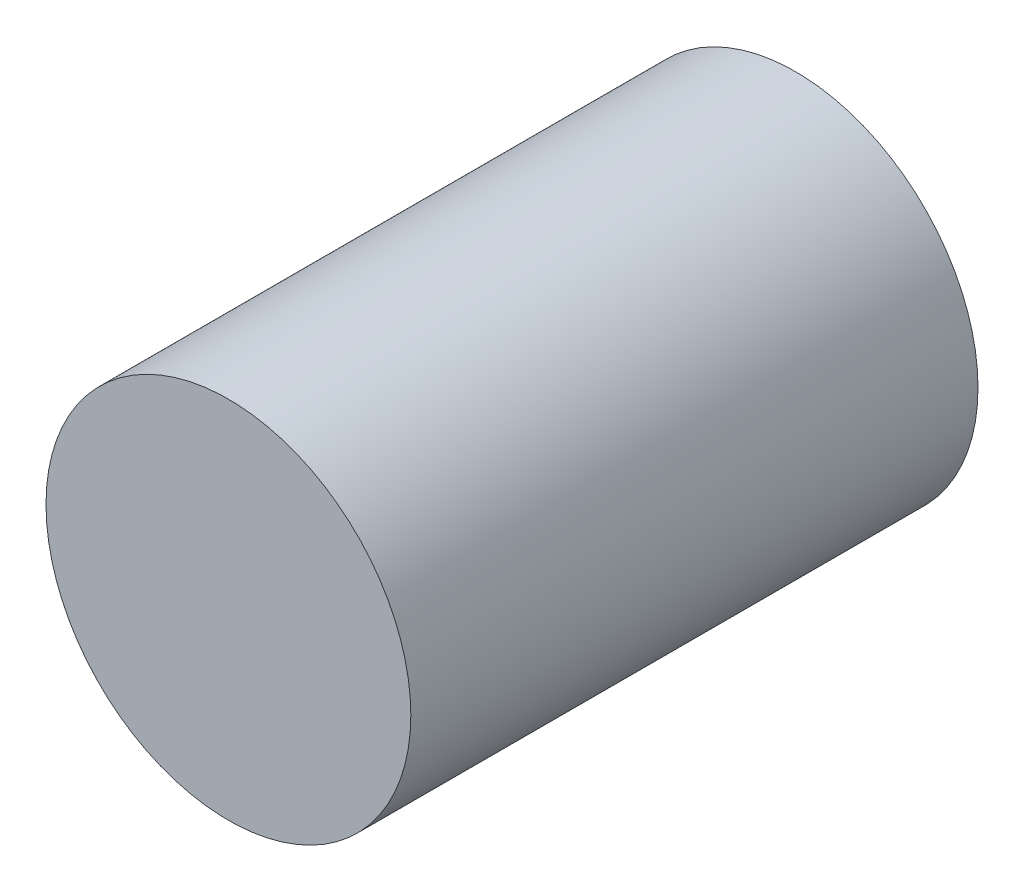
ISO-10303-21;
HEADER;
FILE_DESCRIPTION(('STEP AP214'),'2;1');
FILE_NAME('part.step','',(''),(''),'','','');
FILE_SCHEMA(('AUTOMOTIVE_DESIGN { 1 0 10303 214 1 1 1 1 }'));
ENDSEC;
DATA;
#1=APPLICATION_CONTEXT('core data for automotive mechanical design processes');
#2=APPLICATION_PROTOCOL_DEFINITION('international standard','automotive_design',2000,#1);
#3=PRODUCT_CONTEXT('',#1,'mechanical');
#4=PRODUCT('Part','Part','',(#3));
#5=PRODUCT_RELATED_PRODUCT_CATEGORY('part','',(#4));
#6=PRODUCT_DEFINITION_FORMATION('','',#4);
#7=PRODUCT_DEFINITION_CONTEXT('part definition',#1,'design');
#8=PRODUCT_DEFINITION('design','',#6,#7);
#9=PRODUCT_DEFINITION_SHAPE('','',#8);
#10=(LENGTH_UNIT() NAMED_UNIT(*) SI_UNIT(.MILLI.,.METRE.));
#11=(NAMED_UNIT(*) PLANE_ANGLE_UNIT() SI_UNIT($,.RADIAN.));
#12=(NAMED_UNIT(*) SI_UNIT($,.STERADIAN.) SOLID_ANGLE_UNIT());
#13=UNCERTAINTY_MEASURE_WITH_UNIT(LENGTH_MEASURE(1.E-05),#10,'distance_accuracy_value','');
#14=(GEOMETRIC_REPRESENTATION_CONTEXT(3) GLOBAL_UNCERTAINTY_ASSIGNED_CONTEXT((#13)) GLOBAL_UNIT_ASSIGNED_CONTEXT((#10,
#11,#12)) REPRESENTATION_CONTEXT('',''));
#15=CARTESIAN_POINT('',(0.,0.,0.));
#16=DIRECTION('',(0.,0.,1.));
#17=DIRECTION('',(1.,0.,0.));
#18=AXIS2_PLACEMENT_3D('',#15,#16,#17);
#19=CARTESIAN_POINT('',(0.,0.,7.62));
#20=DIRECTION('',(0.,0.,-1.));
#21=DIRECTION('',(-1.,0.,0.));
#22=AXIS2_PLACEMENT_3D('',#19,#20,#21);
#23=CYLINDRICAL_SURFACE('',#22,1.5875);
#24=CARTESIAN_POINT('',(0.,0.,7.62));
#25=DIRECTION('',(0.,0.,1.));
#26=DIRECTION('',(1.,0.,0.));
#27=AXIS2_PLACEMENT_3D('',#24,#25,#26);
#28=CIRCLE('',#27,1.5875);
#29=CARTESIAN_POINT('',(1.5875,0.,7.62));
#30=VERTEX_POINT('',#29);
#31=EDGE_CURVE('E12',#30,#30,#28,.T.);
#32=ORIENTED_EDGE('',*,*,#31,.F.);
#33=EDGE_LOOP('',(#32));
#34=FACE_BOUND('',#33,.T.);
#35=CARTESIAN_POINT('',(0.,0.,0.));
#36=DIRECTION('',(0.,0.,1.));
#37=DIRECTION('',(1.,0.,0.));
#38=AXIS2_PLACEMENT_3D('',#35,#36,#37);
#39=CIRCLE('',#38,1.5875);
#40=CARTESIAN_POINT('',(1.5875,0.,0.));
#41=VERTEX_POINT('',#40);
#42=EDGE_CURVE('E47',#41,#41,#39,.T.);
#43=ORIENTED_EDGE('',*,*,#42,.T.);
#44=EDGE_LOOP('',(#43));
#45=FACE_BOUND('',#44,.T.);
#46=ADVANCED_FACE('F44',(#34,#45),#23,.T.);
#47=CARTESIAN_POINT('',(0.,0.,0.));
#48=DIRECTION('',(0.,0.,1.));
#49=DIRECTION('',(1.,0.,0.));
#50=AXIS2_PLACEMENT_3D('',#47,#48,#49);
#51=PLANE('',#50);
#52=ORIENTED_EDGE('',*,*,#42,.F.);
#53=EDGE_LOOP('',(#52));
#54=FACE_BOUND('',#53,.T.);
#55=ADVANCED_FACE('F67',(#54),#51,.F.);
#56=CARTESIAN_POINT('',(0.,0.,64.52));
#57=DIRECTION('',(0.,0.,-1.));
#58=DIRECTION('',(-1.,0.,0.));
#59=AXIS2_PLACEMENT_3D('',#56,#57,#58);
#60=CYLINDRICAL_SURFACE('',#59,18.3);
#61=CARTESIAN_POINT('',(0.,0.,64.52));
#62=DIRECTION('',(0.,0.,1.));
#63=DIRECTION('',(1.,0.,0.));
#64=AXIS2_PLACEMENT_3D('',#61,#62,#63);
#65=CIRCLE('',#64,18.3);
#66=CARTESIAN_POINT('',(18.3,0.,64.52));
#67=VERTEX_POINT('',#66);
#68=EDGE_CURVE('E54',#67,#67,#65,.T.);
#69=ORIENTED_EDGE('',*,*,#68,.F.);
#70=EDGE_LOOP('',(#69));
#71=FACE_BOUND('',#70,.T.);
#72=CARTESIAN_POINT('',(0.,0.,7.62));
#73=DIRECTION('',(0.,0.,1.));
#74=DIRECTION('',(1.,0.,0.));
#75=AXIS2_PLACEMENT_3D('',#72,#73,#74);
#76=CIRCLE('',#75,18.3);
#77=CARTESIAN_POINT('',(18.3,0.,7.62));
#78=VERTEX_POINT('',#77);
#79=EDGE_CURVE('E56',#78,#78,#76,.T.);
#80=ORIENTED_EDGE('',*,*,#79,.T.);
#81=EDGE_LOOP('',(#80));
#82=FACE_BOUND('',#81,.T.);
#83=ADVANCED_FACE('F64',(#71,#82),#60,.T.);
#84=CARTESIAN_POINT('',(0.,0.,64.52));
#85=DIRECTION('',(0.,0.,1.));
#86=DIRECTION('',(1.,0.,0.));
#87=AXIS2_PLACEMENT_3D('',#84,#85,#86);
#88=PLANE('',#87);
#89=ORIENTED_EDGE('',*,*,#68,.T.);
#90=EDGE_LOOP('',(#89));
#91=FACE_BOUND('',#90,.T.);
#92=ADVANCED_FACE('F62',(#91),#88,.T.);
#93=CARTESIAN_POINT('',(0.,0.,7.62));
#94=DIRECTION('',(0.,0.,1.));
#95=DIRECTION('',(1.,0.,0.));
#96=AXIS2_PLACEMENT_3D('',#93,#94,#95);
#97=PLANE('',#96);
#98=ORIENTED_EDGE('',*,*,#31,.T.);
#99=EDGE_LOOP('',(#98));
#100=FACE_BOUND('',#99,.T.);
#101=ORIENTED_EDGE('',*,*,#79,.F.);
#102=EDGE_LOOP('',(#101));
#103=FACE_BOUND('',#102,.T.);
#104=ADVANCED_FACE('F71',(#100,#103),#97,.F.);
#105=CLOSED_SHELL('',(#46,#55,#83,#92,#104));
#106=MANIFOLD_SOLID_BREP('B2',#105);
#107=ADVANCED_BREP_SHAPE_REPRESENTATION('',(#18,#106),#14);
#108=SHAPE_DEFINITION_REPRESENTATION(#9,#107);
ENDSEC;
END-ISO-10303-21;
